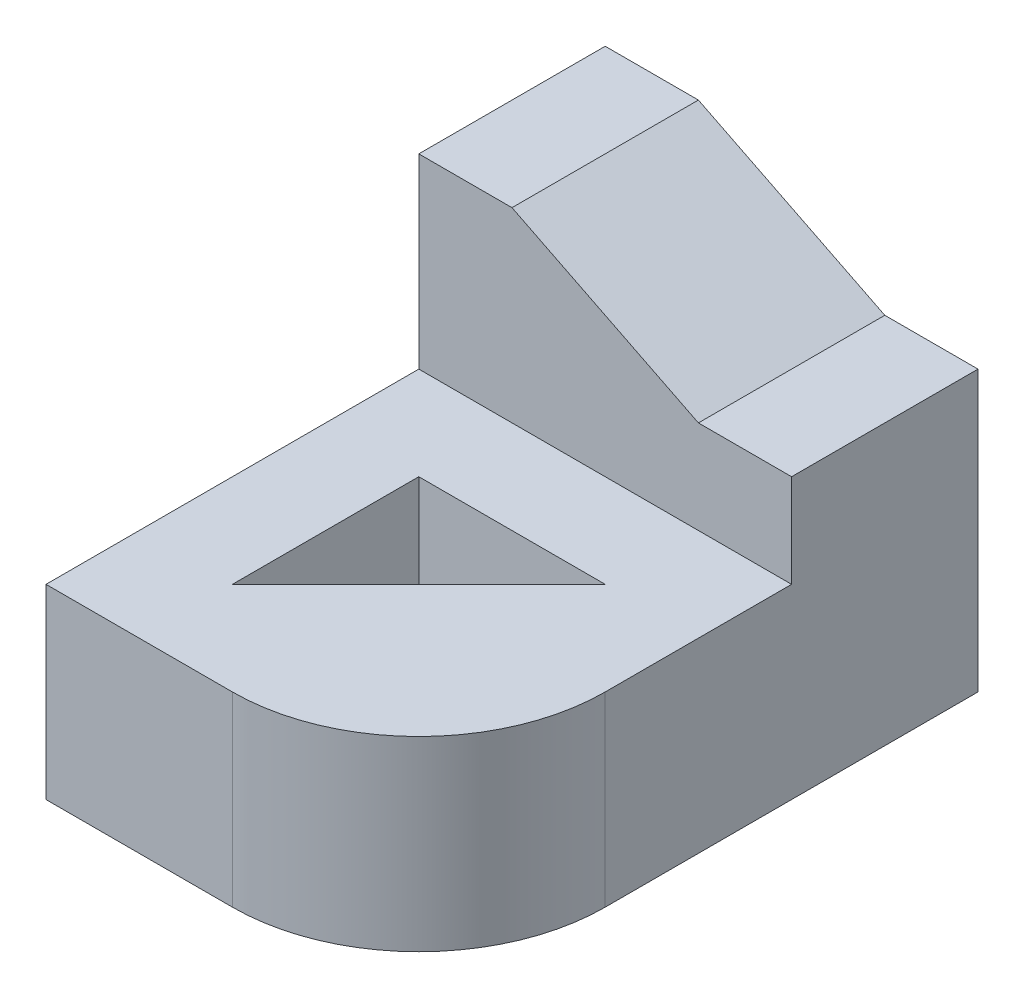
ISO-10303-21;
HEADER;
FILE_DESCRIPTION(('STEP AP214'),'2;1');
FILE_NAME('part.step','',(''),(''),'','','');
FILE_SCHEMA(('AUTOMOTIVE_DESIGN { 1 0 10303 214 1 1 1 1 }'));
ENDSEC;
DATA;
#1=APPLICATION_CONTEXT('core data for automotive mechanical design processes');
#2=APPLICATION_PROTOCOL_DEFINITION('international standard','automotive_design',2000,#1);
#3=PRODUCT_CONTEXT('',#1,'mechanical');
#4=PRODUCT('Part','Part','',(#3));
#5=PRODUCT_RELATED_PRODUCT_CATEGORY('part','',(#4));
#6=PRODUCT_DEFINITION_FORMATION('','',#4);
#7=PRODUCT_DEFINITION_CONTEXT('part definition',#1,'design');
#8=PRODUCT_DEFINITION('design','',#6,#7);
#9=PRODUCT_DEFINITION_SHAPE('','',#8);
#10=(LENGTH_UNIT() NAMED_UNIT(*) SI_UNIT(.MILLI.,.METRE.));
#11=(NAMED_UNIT(*) PLANE_ANGLE_UNIT() SI_UNIT($,.RADIAN.));
#12=(NAMED_UNIT(*) SI_UNIT($,.STERADIAN.) SOLID_ANGLE_UNIT());
#13=UNCERTAINTY_MEASURE_WITH_UNIT(LENGTH_MEASURE(1.E-05),#10,'distance_accuracy_value','');
#14=(GEOMETRIC_REPRESENTATION_CONTEXT(3) GLOBAL_UNCERTAINTY_ASSIGNED_CONTEXT((#13)) GLOBAL_UNIT_ASSIGNED_CONTEXT((#10,
#11,#12)) REPRESENTATION_CONTEXT('',''));
#15=CARTESIAN_POINT('',(0.,0.,0.));
#16=DIRECTION('',(0.,0.,1.));
#17=DIRECTION('',(1.,0.,0.));
#18=AXIS2_PLACEMENT_3D('',#15,#16,#17);
#19=CARTESIAN_POINT('',(1.63156178314107,7.59656560638869,-6.28801223439237));
#20=DIRECTION('',(1.,0.,0.));
#21=DIRECTION('',(0.,0.,-1.));
#22=AXIS2_PLACEMENT_3D('',#19,#20,#21);
#23=PLANE('',#22);
#24=DIRECTION('',(0.,0.,1.));
#25=VECTOR('',#24,1.);
#26=CARTESIAN_POINT('',(1.63156178314107,7.59656560638869,-6.28801223439237));
#27=LINE('',#26,#25);
#28=CARTESIAN_POINT('',(1.63156178314107,7.59656560638869,-8.28801223439237));
#29=VERTEX_POINT('',#28);
#30=CARTESIAN_POINT('',(1.63156178314107,7.59656560638869,-6.28801223439237));
#31=VERTEX_POINT('',#30);
#32=EDGE_CURVE('E183',#29,#31,#27,.T.);
#33=ORIENTED_EDGE('',*,*,#32,.T.);
#34=DIRECTION('',(0.,-1.,0.));
#35=VECTOR('',#34,1.);
#36=CARTESIAN_POINT('',(1.63156178314107,5.59656560638869,-6.28801223439237));
#37=LINE('',#36,#35);
#38=CARTESIAN_POINT('',(1.63156178314107,5.59656560638869,-6.28801223439237));
#39=VERTEX_POINT('',#38);
#40=EDGE_CURVE('E218',#31,#39,#37,.T.);
#41=ORIENTED_EDGE('',*,*,#40,.T.);
#42=DIRECTION('',(0.,0.,1.));
#43=VECTOR('',#42,1.);
#44=CARTESIAN_POINT('',(1.63156178314107,5.59656560638869,-6.28801223439237));
#45=LINE('',#44,#43);
#46=CARTESIAN_POINT('',(1.63156178314107,5.59656560638869,-10.2880122343924));
#47=VERTEX_POINT('',#46);
#48=EDGE_CURVE('E201',#47,#39,#45,.T.);
#49=ORIENTED_EDGE('',*,*,#48,.F.);
#50=DIRECTION('',(0.,-1.,0.));
#51=VECTOR('',#50,1.);
#52=CARTESIAN_POINT('',(1.63156178314107,9.59656560638869,-10.2880122343924));
#53=LINE('',#52,#51);
#54=CARTESIAN_POINT('',(1.63156178314107,8.59656560638869,-10.2880122343924));
#55=VERTEX_POINT('',#54);
#56=EDGE_CURVE('E171',#55,#47,#53,.T.);
#57=ORIENTED_EDGE('',*,*,#56,.F.);
#58=DIRECTION('',(0.,0.,1.));
#59=VECTOR('',#58,1.);
#60=CARTESIAN_POINT('',(1.63156178314107,8.59656560638869,-12.2880122343924));
#61=LINE('',#60,#59);
#62=CARTESIAN_POINT('',(1.63156178314107,8.59656560638869,-8.28801223439237));
#63=VERTEX_POINT('',#62);
#64=EDGE_CURVE('E134',#55,#63,#61,.T.);
#65=ORIENTED_EDGE('',*,*,#64,.T.);
#66=DIRECTION('',(0.,-1.,0.));
#67=VECTOR('',#66,1.);
#68=CARTESIAN_POINT('',(1.63156178314107,9.59656560638869,-8.28801223439237));
#69=LINE('',#68,#67);
#70=EDGE_CURVE('E148',#63,#29,#69,.T.);
#71=ORIENTED_EDGE('',*,*,#70,.T.);
#72=EDGE_LOOP('',(#33,#41,#49,#57,#65,#71));
#73=FACE_BOUND('',#72,.T.);
#74=ADVANCED_FACE('F38',(#73),#23,.T.);
#75=CARTESIAN_POINT('',(-2.36843821685893,7.59656560638869,-6.28801223439237));
#76=DIRECTION('',(1.,0.,0.));
#77=DIRECTION('',(0.,0.,-1.));
#78=AXIS2_PLACEMENT_3D('',#75,#76,#77);
#79=PLANE('',#78);
#80=DIRECTION('',(0.,0.,1.));
#81=VECTOR('',#80,1.);
#82=CARTESIAN_POINT('',(-2.36843821685893,5.59656560638869,-6.28801223439237));
#83=LINE('',#82,#81);
#84=CARTESIAN_POINT('',(-2.36843821685893,5.59656560638869,-10.2880122343924));
#85=VERTEX_POINT('',#84);
#86=CARTESIAN_POINT('',(-2.36843821685893,5.59656560638869,-4.28801223439237));
#87=VERTEX_POINT('',#86);
#88=EDGE_CURVE('E203',#85,#87,#83,.T.);
#89=ORIENTED_EDGE('',*,*,#88,.T.);
#90=DIRECTION('',(0.,-1.,0.));
#91=VECTOR('',#90,1.);
#92=CARTESIAN_POINT('',(-2.36843821685893,7.59656560638869,-4.28801223439237));
#93=LINE('',#92,#91);
#94=CARTESIAN_POINT('',(-2.36843821685893,7.59656560638869,-4.28801223439237));
#95=VERTEX_POINT('',#94);
#96=EDGE_CURVE('E207',#95,#87,#93,.T.);
#97=ORIENTED_EDGE('',*,*,#96,.F.);
#98=DIRECTION('',(0.,0.,1.));
#99=VECTOR('',#98,1.);
#100=CARTESIAN_POINT('',(-2.36843821685893,7.59656560638869,-6.28801223439237));
#101=LINE('',#100,#99);
#102=CARTESIAN_POINT('',(-2.36843821685893,7.59656560638869,-8.28801223439237));
#103=VERTEX_POINT('',#102);
#104=EDGE_CURVE('E188',#103,#95,#101,.T.);
#105=ORIENTED_EDGE('',*,*,#104,.F.);
#106=DIRECTION('',(0.,-1.,0.));
#107=VECTOR('',#106,1.);
#108=CARTESIAN_POINT('',(-2.36843821685893,9.59656560638869,-8.28801223439237));
#109=LINE('',#108,#107);
#110=CARTESIAN_POINT('',(-2.36843821685893,9.59656560638869,-8.28801223439237));
#111=VERTEX_POINT('',#110);
#112=EDGE_CURVE('E163',#111,#103,#109,.T.);
#113=ORIENTED_EDGE('',*,*,#112,.F.);
#114=DIRECTION('',(0.,0.,-1.));
#115=VECTOR('',#114,1.);
#116=CARTESIAN_POINT('',(-2.36843821685893,9.59656560638869,-6.28801223439237));
#117=LINE('',#116,#115);
#118=CARTESIAN_POINT('',(-2.36843821685893,9.59656560638869,-10.2880122343924));
#119=VERTEX_POINT('',#118);
#120=EDGE_CURVE('E160',#111,#119,#117,.T.);
#121=ORIENTED_EDGE('',*,*,#120,.T.);
#122=DIRECTION('',(0.,-1.,0.));
#123=VECTOR('',#122,1.);
#124=CARTESIAN_POINT('',(-2.36843821685893,9.59656560638869,-10.2880122343924));
#125=LINE('',#124,#123);
#126=EDGE_CURVE('E168',#119,#85,#125,.T.);
#127=ORIENTED_EDGE('',*,*,#126,.T.);
#128=EDGE_LOOP('',(#89,#97,#105,#113,#121,#127));
#129=FACE_BOUND('',#128,.T.);
#130=ADVANCED_FACE('F238',(#129),#79,.F.);
#131=CARTESIAN_POINT('',(-1.36843821685893,7.59656560638869,-6.28801223439237));
#132=DIRECTION('',(1.,0.,0.));
#133=DIRECTION('',(0.,0.,-1.));
#134=AXIS2_PLACEMENT_3D('',#131,#132,#133);
#135=PLANE('',#134);
#136=DIRECTION('',(0.,0.,1.));
#137=VECTOR('',#136,1.);
#138=CARTESIAN_POINT('',(-1.36843821685893,5.59656560638869,-6.28801223439237));
#139=LINE('',#138,#137);
#140=CARTESIAN_POINT('',(-1.36843821685893,5.59656560638869,-7.28801223439237));
#141=VERTEX_POINT('',#140);
#142=CARTESIAN_POINT('',(-1.36843821685893,5.59656560638869,-5.28801223439237));
#143=VERTEX_POINT('',#142);
#144=EDGE_CURVE('E174',#141,#143,#139,.T.);
#145=ORIENTED_EDGE('',*,*,#144,.F.);
#146=DIRECTION('',(0.,-1.,0.));
#147=VECTOR('',#146,1.);
#148=CARTESIAN_POINT('',(-1.36843821685893,7.59656560638869,-7.28801223439237));
#149=LINE('',#148,#147);
#150=CARTESIAN_POINT('',(-1.36843821685893,7.59656560638869,-7.28801223439237));
#151=VERTEX_POINT('',#150);
#152=EDGE_CURVE('E210',#151,#141,#149,.T.);
#153=ORIENTED_EDGE('',*,*,#152,.F.);
#154=DIRECTION('',(0.,0.,1.));
#155=VECTOR('',#154,1.);
#156=CARTESIAN_POINT('',(-1.36843821685893,7.59656560638869,-6.28801223439237));
#157=LINE('',#156,#155);
#158=CARTESIAN_POINT('',(-1.36843821685893,7.59656560638869,-5.28801223439237));
#159=VERTEX_POINT('',#158);
#160=EDGE_CURVE('E175',#151,#159,#157,.T.);
#161=ORIENTED_EDGE('',*,*,#160,.T.);
#162=DIRECTION('',(0.,-1.,0.));
#163=VECTOR('',#162,1.);
#164=CARTESIAN_POINT('',(-1.36843821685893,7.59656560638869,-5.28801223439237));
#165=LINE('',#164,#163);
#166=EDGE_CURVE('E193',#159,#143,#165,.T.);
#167=ORIENTED_EDGE('',*,*,#166,.T.);
#168=EDGE_LOOP('',(#145,#153,#161,#167));
#169=FACE_BOUND('',#168,.T.);
#170=ADVANCED_FACE('F250',(#169),#135,.T.);
#171=CARTESIAN_POINT('',(-0.368438216858929,7.59656560638869,-7.28801223439237));
#172=DIRECTION('',(0.,0.,-1.));
#173=DIRECTION('',(-1.,0.,0.));
#174=AXIS2_PLACEMENT_3D('',#171,#172,#173);
#175=PLANE('',#174);
#176=DIRECTION('',(1.,0.,0.));
#177=VECTOR('',#176,1.);
#178=CARTESIAN_POINT('',(-0.368438216858929,5.59656560638869,-7.28801223439237));
#179=LINE('',#178,#177);
#180=CARTESIAN_POINT('',(0.631561783141071,5.59656560638869,-7.28801223439237));
#181=VERTEX_POINT('',#180);
#182=EDGE_CURVE('E196',#141,#181,#179,.T.);
#183=ORIENTED_EDGE('',*,*,#182,.T.);
#184=DIRECTION('',(0.,-1.,0.));
#185=VECTOR('',#184,1.);
#186=CARTESIAN_POINT('',(0.631561783141071,7.59656560638869,-7.28801223439237));
#187=LINE('',#186,#185);
#188=CARTESIAN_POINT('',(0.631561783141071,7.59656560638869,-7.28801223439237));
#189=VERTEX_POINT('',#188);
#190=EDGE_CURVE('E212',#189,#181,#187,.T.);
#191=ORIENTED_EDGE('',*,*,#190,.F.);
#192=DIRECTION('',(1.,0.,0.));
#193=VECTOR('',#192,1.);
#194=CARTESIAN_POINT('',(-0.368438216858929,7.59656560638869,-7.28801223439237));
#195=LINE('',#194,#193);
#196=EDGE_CURVE('E178',#151,#189,#195,.T.);
#197=ORIENTED_EDGE('',*,*,#196,.F.);
#198=ORIENTED_EDGE('',*,*,#152,.T.);
#199=EDGE_LOOP('',(#183,#191,#197,#198));
#200=FACE_BOUND('',#199,.T.);
#201=ADVANCED_FACE('F258',(#200),#175,.F.);
#202=CARTESIAN_POINT('',(-0.368438216858929,7.59656560638869,-6.28801223439237));
#203=DIRECTION('',(0.707106781186548,0.,0.707106781186548));
#204=DIRECTION('',(0.707106781186548,0.,-0.707106781186548));
#205=AXIS2_PLACEMENT_3D('',#202,#203,#204);
#206=PLANE('',#205);
#207=DIRECTION('',(-0.707106781186548,0.,0.707106781186548));
#208=VECTOR('',#207,1.);
#209=CARTESIAN_POINT('',(-0.368438216858929,5.59656560638869,-6.28801223439237));
#210=LINE('',#209,#208);
#211=EDGE_CURVE('E198',#181,#143,#210,.T.);
#212=ORIENTED_EDGE('',*,*,#211,.T.);
#213=ORIENTED_EDGE('',*,*,#166,.F.);
#214=DIRECTION('',(-0.707106781186548,0.,0.707106781186548));
#215=VECTOR('',#214,1.);
#216=CARTESIAN_POINT('',(-0.368438216858929,7.59656560638869,-6.28801223439237));
#217=LINE('',#216,#215);
#218=EDGE_CURVE('E181',#189,#159,#217,.T.);
#219=ORIENTED_EDGE('',*,*,#218,.F.);
#220=ORIENTED_EDGE('',*,*,#190,.T.);
#221=EDGE_LOOP('',(#212,#213,#219,#220));
#222=FACE_BOUND('',#221,.T.);
#223=ADVANCED_FACE('F254',(#222),#206,.F.);
#224=CARTESIAN_POINT('',(-0.368438216858929,7.59656560638869,-4.28801223439237));
#225=DIRECTION('',(0.,0.,-1.));
#226=DIRECTION('',(-1.,0.,0.));
#227=AXIS2_PLACEMENT_3D('',#224,#225,#226);
#228=PLANE('',#227);
#229=DIRECTION('',(1.,0.,0.));
#230=VECTOR('',#229,1.);
#231=CARTESIAN_POINT('',(-0.368438216858929,5.59656560638869,-4.28801223439237));
#232=LINE('',#231,#230);
#233=CARTESIAN_POINT('',(-0.36843821685893,5.59656560638869,-4.28801223439237));
#234=VERTEX_POINT('',#233);
#235=EDGE_CURVE('E179',#87,#234,#232,.T.);
#236=ORIENTED_EDGE('',*,*,#235,.T.);
#237=DIRECTION('',(0.,-1.,0.));
#238=VECTOR('',#237,1.);
#239=CARTESIAN_POINT('',(-0.36843821685893,7.59656560638869,-4.28801223439237));
#240=LINE('',#239,#238);
#241=CARTESIAN_POINT('',(-0.36843821685893,7.59656560638869,-4.28801223439237));
#242=VERTEX_POINT('',#241);
#243=EDGE_CURVE('E46',#234,#242,#240,.F.);
#244=ORIENTED_EDGE('',*,*,#243,.T.);
#245=DIRECTION('',(1.,0.,0.));
#246=VECTOR('',#245,1.);
#247=CARTESIAN_POINT('',(-0.368438216858929,7.59656560638869,-4.28801223439237));
#248=LINE('',#247,#246);
#249=EDGE_CURVE('E191',#95,#242,#248,.T.);
#250=ORIENTED_EDGE('',*,*,#249,.F.);
#251=ORIENTED_EDGE('',*,*,#96,.T.);
#252=EDGE_LOOP('',(#236,#244,#250,#251));
#253=FACE_BOUND('',#252,.T.);
#254=ADVANCED_FACE('F257',(#253),#228,.F.);
#255=CARTESIAN_POINT('',(-0.368438216858929,7.59656560638869,-6.28801223439237));
#256=DIRECTION('',(0.,1.,0.));
#257=DIRECTION('',(0.,0.,1.));
#258=AXIS2_PLACEMENT_3D('',#255,#256,#257);
#259=PLANE('',#258);
#260=ORIENTED_EDGE('',*,*,#160,.F.);
#261=ORIENTED_EDGE('',*,*,#196,.T.);
#262=ORIENTED_EDGE('',*,*,#218,.T.);
#263=EDGE_LOOP('',(#260,#261,#262));
#264=FACE_BOUND('',#263,.T.);
#265=ORIENTED_EDGE('',*,*,#249,.T.);
#266=CARTESIAN_POINT('',(-0.36843821685893,7.59656560638869,-6.28801223439237));
#267=DIRECTION('',(0.,1.,0.));
#268=DIRECTION('',(0.,0.,1.));
#269=AXIS2_PLACEMENT_3D('',#266,#267,#268);
#270=CIRCLE('',#269,2.);
#271=EDGE_CURVE('E11',#242,#31,#270,.T.);
#272=ORIENTED_EDGE('',*,*,#271,.T.);
#273=ORIENTED_EDGE('',*,*,#32,.F.);
#274=DIRECTION('',(1.,0.,0.));
#275=VECTOR('',#274,1.);
#276=CARTESIAN_POINT('',(-0.36843821685893,7.59656560638869,-8.28801223439237));
#277=LINE('',#276,#275);
#278=EDGE_CURVE('E186',#103,#29,#277,.T.);
#279=ORIENTED_EDGE('',*,*,#278,.F.);
#280=ORIENTED_EDGE('',*,*,#104,.T.);
#281=EDGE_LOOP('',(#265,#272,#273,#279,#280));
#282=FACE_BOUND('',#281,.T.);
#283=ADVANCED_FACE('F235',(#264,#282),#259,.T.);
#284=CARTESIAN_POINT('',(-0.368438216858929,5.59656560638869,-6.28801223439237));
#285=DIRECTION('',(0.,1.,0.));
#286=DIRECTION('',(0.,0.,1.));
#287=AXIS2_PLACEMENT_3D('',#284,#285,#286);
#288=PLANE('',#287);
#289=ORIENTED_EDGE('',*,*,#144,.T.);
#290=ORIENTED_EDGE('',*,*,#211,.F.);
#291=ORIENTED_EDGE('',*,*,#182,.F.);
#292=EDGE_LOOP('',(#289,#290,#291));
#293=FACE_BOUND('',#292,.T.);
#294=ORIENTED_EDGE('',*,*,#48,.T.);
#295=CARTESIAN_POINT('',(-0.36843821685893,5.59656560638869,-6.28801223439237));
#296=DIRECTION('',(0.,1.,0.));
#297=DIRECTION('',(0.,0.,1.));
#298=AXIS2_PLACEMENT_3D('',#295,#296,#297);
#299=CIRCLE('',#298,2.);
#300=EDGE_CURVE('E60',#39,#234,#299,.F.);
#301=ORIENTED_EDGE('',*,*,#300,.T.);
#302=ORIENTED_EDGE('',*,*,#235,.F.);
#303=ORIENTED_EDGE('',*,*,#88,.F.);
#304=DIRECTION('',(1.,0.,0.));
#305=VECTOR('',#304,1.);
#306=CARTESIAN_POINT('',(-0.368438216858929,5.59656560638869,-10.2880122343924));
#307=LINE('',#306,#305);
#308=EDGE_CURVE('E154',#85,#47,#307,.T.);
#309=ORIENTED_EDGE('',*,*,#308,.T.);
#310=EDGE_LOOP('',(#294,#301,#302,#303,#309));
#311=FACE_BOUND('',#310,.T.);
#312=ADVANCED_FACE('F228',(#293,#311),#288,.F.);
#313=CARTESIAN_POINT('',(-0.36843821685893,9.59656560638869,-8.28801223439237));
#314=DIRECTION('',(0.,0.,-1.));
#315=DIRECTION('',(-1.,0.,0.));
#316=AXIS2_PLACEMENT_3D('',#313,#314,#315);
#317=PLANE('',#316);
#318=DIRECTION('',(1.,0.,0.));
#319=VECTOR('',#318,1.);
#320=CARTESIAN_POINT('',(-0.368438216858929,8.59656560638869,-8.28801223439237));
#321=LINE('',#320,#319);
#322=CARTESIAN_POINT('',(0.631561783141069,8.59656560638869,-8.28801223439237));
#323=VERTEX_POINT('',#322);
#324=EDGE_CURVE('E128',#323,#63,#321,.T.);
#325=ORIENTED_EDGE('',*,*,#324,.F.);
#326=DIRECTION('',(0.894427190999916,-0.447213595499958,0.));
#327=VECTOR('',#326,1.);
#328=CARTESIAN_POINT('',(1.03156178314107,8.39656560638869,-8.28801223439237));
#329=LINE('',#328,#327);
#330=CARTESIAN_POINT('',(-1.36843821685893,9.59656560638869,-8.28801223439237));
#331=VERTEX_POINT('',#330);
#332=EDGE_CURVE('E137',#331,#323,#329,.T.);
#333=ORIENTED_EDGE('',*,*,#332,.F.);
#334=DIRECTION('',(1.,0.,0.));
#335=VECTOR('',#334,1.);
#336=CARTESIAN_POINT('',(-0.36843821685893,9.59656560638869,-8.28801223439237));
#337=LINE('',#336,#335);
#338=EDGE_CURVE('E155',#111,#331,#337,.T.);
#339=ORIENTED_EDGE('',*,*,#338,.F.);
#340=ORIENTED_EDGE('',*,*,#112,.T.);
#341=ORIENTED_EDGE('',*,*,#278,.T.);
#342=ORIENTED_EDGE('',*,*,#70,.F.);
#343=EDGE_LOOP('',(#325,#333,#339,#340,#341,#342));
#344=FACE_BOUND('',#343,.T.);
#345=ADVANCED_FACE('F146',(#344),#317,.F.);
#346=CARTESIAN_POINT('',(-0.368438216858929,9.59656560638869,-10.2880122343924));
#347=DIRECTION('',(0.,0.,-1.));
#348=DIRECTION('',(-1.,0.,0.));
#349=AXIS2_PLACEMENT_3D('',#346,#347,#348);
#350=PLANE('',#349);
#351=DIRECTION('',(-0.894427190999916,0.447213595499958,0.));
#352=VECTOR('',#351,1.);
#353=CARTESIAN_POINT('',(-0.568438216858929,9.19656560638869,-10.2880122343924));
#354=LINE('',#353,#352);
#355=CARTESIAN_POINT('',(0.631561783141069,8.59656560638869,-10.2880122343924));
#356=VERTEX_POINT('',#355);
#357=CARTESIAN_POINT('',(-1.36843821685893,9.59656560638869,-10.2880122343924));
#358=VERTEX_POINT('',#357);
#359=EDGE_CURVE('E151',#356,#358,#354,.T.);
#360=ORIENTED_EDGE('',*,*,#359,.F.);
#361=DIRECTION('',(-1.,0.,0.));
#362=VECTOR('',#361,1.);
#363=CARTESIAN_POINT('',(-0.368438216858929,8.59656560638869,-10.2880122343924));
#364=LINE('',#363,#362);
#365=EDGE_CURVE('E131',#55,#356,#364,.T.);
#366=ORIENTED_EDGE('',*,*,#365,.F.);
#367=ORIENTED_EDGE('',*,*,#56,.T.);
#368=ORIENTED_EDGE('',*,*,#308,.F.);
#369=ORIENTED_EDGE('',*,*,#126,.F.);
#370=DIRECTION('',(1.,0.,0.));
#371=VECTOR('',#370,1.);
#372=CARTESIAN_POINT('',(-0.368438216858929,9.59656560638869,-10.2880122343924));
#373=LINE('',#372,#371);
#374=EDGE_CURVE('E157',#119,#358,#373,.T.);
#375=ORIENTED_EDGE('',*,*,#374,.T.);
#376=EDGE_LOOP('',(#360,#366,#367,#368,#369,#375));
#377=FACE_BOUND('',#376,.T.);
#378=ADVANCED_FACE('F231',(#377),#350,.T.);
#379=CARTESIAN_POINT('',(-0.368438216858929,9.59656560638869,-6.28801223439237));
#380=DIRECTION('',(0.,1.,0.));
#381=DIRECTION('',(0.,0.,1.));
#382=AXIS2_PLACEMENT_3D('',#379,#380,#381);
#383=PLANE('',#382);
#384=DIRECTION('',(0.,0.,1.));
#385=VECTOR('',#384,1.);
#386=CARTESIAN_POINT('',(-1.36843821685893,9.59656560638869,-6.28801223439237));
#387=LINE('',#386,#385);
#388=EDGE_CURVE('E140',#358,#331,#387,.T.);
#389=ORIENTED_EDGE('',*,*,#388,.F.);
#390=ORIENTED_EDGE('',*,*,#374,.F.);
#391=ORIENTED_EDGE('',*,*,#120,.F.);
#392=ORIENTED_EDGE('',*,*,#338,.T.);
#393=EDGE_LOOP('',(#389,#390,#391,#392));
#394=FACE_BOUND('',#393,.T.);
#395=ADVANCED_FACE('F288',(#394),#383,.T.);
#396=CARTESIAN_POINT('',(1.03156178314107,8.39656560638869,-12.2880122343924));
#397=DIRECTION('',(-0.447213595499958,-0.894427190999916,0.));
#398=DIRECTION('',(0.894427190999916,-0.447213595499958,0.));
#399=AXIS2_PLACEMENT_3D('',#396,#397,#398);
#400=PLANE('',#399);
#401=ORIENTED_EDGE('',*,*,#359,.T.);
#402=ORIENTED_EDGE('',*,*,#388,.T.);
#403=ORIENTED_EDGE('',*,*,#332,.T.);
#404=DIRECTION('',(0.,0.,1.));
#405=VECTOR('',#404,1.);
#406=CARTESIAN_POINT('',(0.631561783141069,8.59656560638869,-12.2880122343924));
#407=LINE('',#406,#405);
#408=EDGE_CURVE('E124',#356,#323,#407,.T.);
#409=ORIENTED_EDGE('',*,*,#408,.F.);
#410=EDGE_LOOP('',(#401,#402,#403,#409));
#411=FACE_BOUND('',#410,.T.);
#412=ADVANCED_FACE('F138',(#411),#400,.F.);
#413=CARTESIAN_POINT('',(-0.368438216858929,8.59656560638869,-12.2880122343924));
#414=DIRECTION('',(0.,-1.,0.));
#415=DIRECTION('',(0.,0.,-1.));
#416=AXIS2_PLACEMENT_3D('',#413,#414,#415);
#417=PLANE('',#416);
#418=ORIENTED_EDGE('',*,*,#365,.T.);
#419=ORIENTED_EDGE('',*,*,#408,.T.);
#420=ORIENTED_EDGE('',*,*,#324,.T.);
#421=ORIENTED_EDGE('',*,*,#64,.F.);
#422=EDGE_LOOP('',(#418,#419,#420,#421));
#423=FACE_BOUND('',#422,.T.);
#424=ADVANCED_FACE('F126',(#423),#417,.F.);
#425=CARTESIAN_POINT('',(-0.36843821685893,7.59656560638869,-6.28801223439237));
#426=DIRECTION('',(0.,1.,0.));
#427=DIRECTION('',(0.,0.,1.));
#428=AXIS2_PLACEMENT_3D('',#425,#426,#427);
#429=CYLINDRICAL_SURFACE('',#428,2.);
#430=ORIENTED_EDGE('',*,*,#271,.F.);
#431=ORIENTED_EDGE('',*,*,#243,.F.);
#432=ORIENTED_EDGE('',*,*,#300,.F.);
#433=ORIENTED_EDGE('',*,*,#40,.F.);
#434=EDGE_LOOP('',(#430,#431,#432,#433));
#435=FACE_BOUND('',#434,.T.);
#436=ADVANCED_FACE('F40',(#435),#429,.T.);
#437=CLOSED_SHELL('',(#74,#130,#170,#201,#223,#254,#283,#312,#345,#378,#395,#412,#424,#436));
#438=MANIFOLD_SOLID_BREP('B2',#437);
#439=ADVANCED_BREP_SHAPE_REPRESENTATION('',(#18,#438),#14);
#440=SHAPE_DEFINITION_REPRESENTATION(#9,#439);
ENDSEC;
END-ISO-10303-21;
